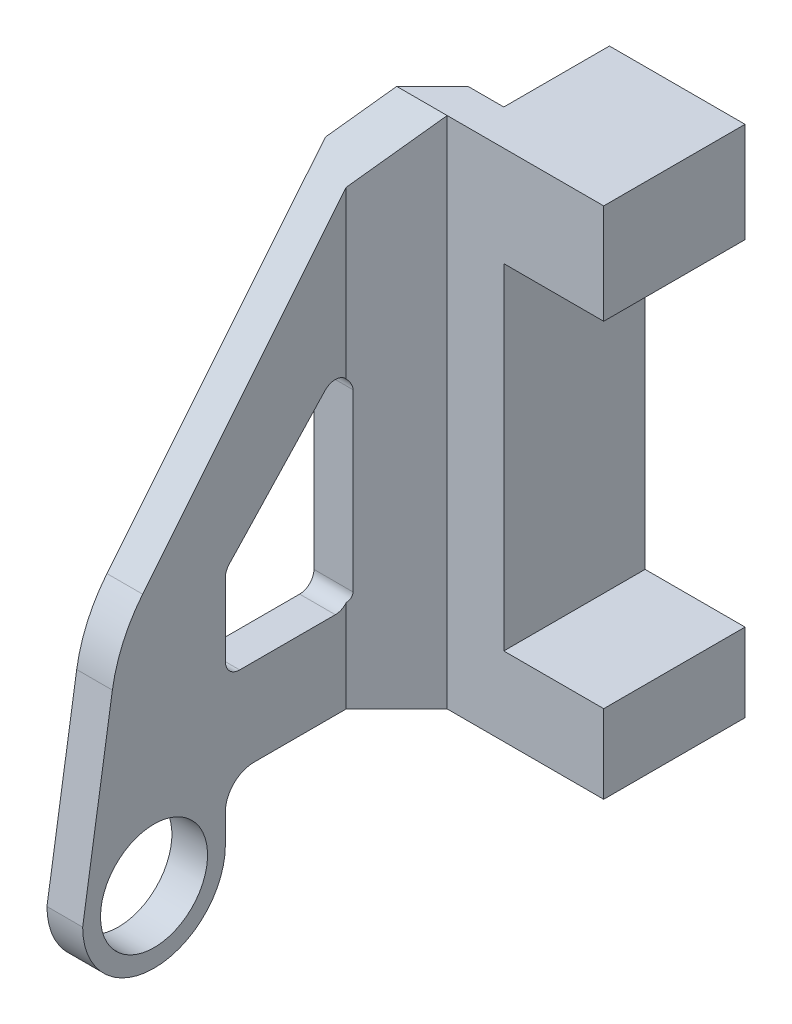
ISO-10303-21;
HEADER;
FILE_DESCRIPTION(('STEP AP214'),'2;1');
FILE_NAME('part.step','',(''),(''),'','','');
FILE_SCHEMA(('AUTOMOTIVE_DESIGN { 1 0 10303 214 1 1 1 1 }'));
ENDSEC;
DATA;
#1=APPLICATION_CONTEXT('core data for automotive mechanical design processes');
#2=APPLICATION_PROTOCOL_DEFINITION('international standard','automotive_design',2000,#1);
#3=PRODUCT_CONTEXT('',#1,'mechanical');
#4=PRODUCT('Part','Part','',(#3));
#5=PRODUCT_RELATED_PRODUCT_CATEGORY('part','',(#4));
#6=PRODUCT_DEFINITION_FORMATION('','',#4);
#7=PRODUCT_DEFINITION_CONTEXT('part definition',#1,'design');
#8=PRODUCT_DEFINITION('design','',#6,#7);
#9=PRODUCT_DEFINITION_SHAPE('','',#8);
#10=(LENGTH_UNIT() NAMED_UNIT(*) SI_UNIT(.MILLI.,.METRE.));
#11=(NAMED_UNIT(*) PLANE_ANGLE_UNIT() SI_UNIT($,.RADIAN.));
#12=(NAMED_UNIT(*) SI_UNIT($,.STERADIAN.) SOLID_ANGLE_UNIT());
#13=UNCERTAINTY_MEASURE_WITH_UNIT(LENGTH_MEASURE(1.E-05),#10,'distance_accuracy_value','');
#14=(GEOMETRIC_REPRESENTATION_CONTEXT(3) GLOBAL_UNCERTAINTY_ASSIGNED_CONTEXT((#13)) GLOBAL_UNIT_ASSIGNED_CONTEXT((#10,
#11,#12)) REPRESENTATION_CONTEXT('',''));
#15=CARTESIAN_POINT('',(0.,0.,0.));
#16=DIRECTION('',(0.,0.,1.));
#17=DIRECTION('',(1.,0.,0.));
#18=AXIS2_PLACEMENT_3D('',#15,#16,#17);
#19=CARTESIAN_POINT('',(-17.,-4.,26.9));
#20=DIRECTION('',(-1.,0.,0.));
#21=DIRECTION('',(0.,0.,1.));
#22=AXIS2_PLACEMENT_3D('',#19,#20,#21);
#23=PLANE('',#22);
#24=CARTESIAN_POINT('',(-17.,-4.,26.9));
#25=DIRECTION('',(-1.,0.,0.));
#26=DIRECTION('',(0.,0.,1.));
#27=AXIS2_PLACEMENT_3D('',#24,#25,#26);
#28=CIRCLE('',#27,3.75);
#29=CARTESIAN_POINT('',(-17.,-4.,30.65));
#30=VERTEX_POINT('',#29);
#31=EDGE_CURVE('E776',#30,#30,#28,.T.);
#32=ORIENTED_EDGE('',*,*,#31,.F.);
#33=EDGE_LOOP('',(#32));
#34=FACE_BOUND('',#33,.T.);
#35=DIRECTION('',(0.,0.988012033751101,-0.15437688027361));
#36=VECTOR('',#35,1.);
#37=CARTESIAN_POINT('',(-17.,-4.,31.9));
#38=LINE('',#37,#36);
#39=CARTESIAN_POINT('',(-17.,-4.,31.9));
#40=VERTEX_POINT('',#39);
#41=CARTESIAN_POINT('',(-17.,9.33291795760597,29.8167315691241));
#42=VERTEX_POINT('',#41);
#43=EDGE_CURVE('E312',#40,#42,#38,.T.);
#44=ORIENTED_EDGE('',*,*,#43,.T.);
#45=CARTESIAN_POINT('',(-17.,7.78914915486987,19.9366112316131));
#46=DIRECTION('',(-1.,0.,0.));
#47=DIRECTION('',(0.,0.,1.));
#48=AXIS2_PLACEMENT_3D('',#45,#46,#47);
#49=CIRCLE('',#48,10.);
#50=CARTESIAN_POINT('',(-17.,14.0950754058145,27.6977512327757));
#51=VERTEX_POINT('',#50);
#52=EDGE_CURVE('E367',#42,#51,#49,.T.);
#53=ORIENTED_EDGE('',*,*,#52,.T.);
#54=DIRECTION('',(0.,0.776114000116266,-0.630592625094466));
#55=VECTOR('',#54,1.);
#56=CARTESIAN_POINT('',(-17.,12.,29.4));
#57=LINE('',#56,#55);
#58=CARTESIAN_POINT('',(-17.,32.923076923077,12.3999999999999));
#59=VERTEX_POINT('',#58);
#60=EDGE_CURVE('E315',#51,#59,#57,.T.);
#61=ORIENTED_EDGE('',*,*,#60,.T.);
#62=DIRECTION('',(0.,1.,0.));
#63=VECTOR('',#62,1.);
#64=CARTESIAN_POINT('',(-17.,-4.,12.3999999999999));
#65=LINE('',#64,#63);
#66=CARTESIAN_POINT('',(-17.,0.,12.3999999999999));
#67=VERTEX_POINT('',#66);
#68=EDGE_CURVE('E299',#67,#59,#65,.T.);
#69=ORIENTED_EDGE('',*,*,#68,.F.);
#70=DIRECTION('',(0.,0.,1.));
#71=VECTOR('',#70,1.);
#72=CARTESIAN_POINT('',(-17.,0.,7.4));
#73=LINE('',#72,#71);
#74=CARTESIAN_POINT('',(-17.,0.,19.9));
#75=VERTEX_POINT('',#74);
#76=EDGE_CURVE('E306',#67,#75,#73,.T.);
#77=ORIENTED_EDGE('',*,*,#76,.T.);
#78=CARTESIAN_POINT('',(-17.,-2.,19.9));
#79=DIRECTION('',(-1.,0.,0.));
#80=DIRECTION('',(0.,0.,1.));
#81=AXIS2_PLACEMENT_3D('',#78,#79,#80);
#82=CIRCLE('',#81,2.);
#83=CARTESIAN_POINT('',(-17.,-2.,21.9));
#84=VERTEX_POINT('',#83);
#85=EDGE_CURVE('E11',#75,#84,#82,.F.);
#86=ORIENTED_EDGE('',*,*,#85,.T.);
#87=DIRECTION('',(0.,-1.,0.));
#88=VECTOR('',#87,1.);
#89=CARTESIAN_POINT('',(-17.,0.,21.9));
#90=LINE('',#89,#88);
#91=CARTESIAN_POINT('',(-17.,-4.,21.9));
#92=VERTEX_POINT('',#91);
#93=EDGE_CURVE('E308',#84,#92,#90,.T.);
#94=ORIENTED_EDGE('',*,*,#93,.T.);
#95=CARTESIAN_POINT('',(-17.,-4.,26.9));
#96=DIRECTION('',(-1.,0.,0.));
#97=DIRECTION('',(0.,0.,1.));
#98=AXIS2_PLACEMENT_3D('',#95,#96,#97);
#99=CIRCLE('',#98,5.);
#100=EDGE_CURVE('E310',#92,#40,#99,.T.);
#101=ORIENTED_EDGE('',*,*,#100,.T.);
#102=EDGE_LOOP('',(#44,#53,#61,#69,#77,#86,#94,#101));
#103=FACE_BOUND('',#102,.T.);
#104=CARTESIAN_POINT('',(-17.,19.3672423947041,14.2));
#105=DIRECTION('',(-1.,0.,0.));
#106=DIRECTION('',(0.,0.,1.));
#107=AXIS2_PLACEMENT_3D('',#104,#105,#106);
#108=CIRCLE('',#107,1.);
#109=CARTESIAN_POINT('',(-17.,20.0503995234798,14.9302714135189));
#110=VERTEX_POINT('',#109);
#111=CARTESIAN_POINT('',(-17.,19.3672423947041,13.2));
#112=VERTEX_POINT('',#111);
#113=EDGE_CURVE('E230',#110,#112,#108,.T.);
#114=ORIENTED_EDGE('',*,*,#113,.F.);
#115=DIRECTION('',(0.,-0.730271413518896,0.683157128775741));
#116=VECTOR('',#115,1.);
#117=CARTESIAN_POINT('',(-17.,16.8061598224195,17.965205327414));
#118=LINE('',#117,#116);
#119=CARTESIAN_POINT('',(-17.,12.8883305579626,21.6302714135189));
#120=VERTEX_POINT('',#119);
#121=EDGE_CURVE('E235',#110,#120,#118,.T.);
#122=ORIENTED_EDGE('',*,*,#121,.T.);
#123=CARTESIAN_POINT('',(-17.,12.2051734291868,20.9));
#124=DIRECTION('',(-1.,0.,0.));
#125=DIRECTION('',(0.,0.,1.));
#126=AXIS2_PLACEMENT_3D('',#123,#124,#125);
#127=CIRCLE('',#126,1.);
#128=CARTESIAN_POINT('',(-17.,12.2051734291868,21.9));
#129=VERTEX_POINT('',#128);
#130=EDGE_CURVE('E252',#129,#120,#127,.T.);
#131=ORIENTED_EDGE('',*,*,#130,.F.);
#132=DIRECTION('',(0.,-1.,0.));
#133=VECTOR('',#132,1.);
#134=CARTESIAN_POINT('',(-17.,0.,21.9));
#135=LINE('',#134,#133);
#136=CARTESIAN_POINT('',(-17.,7.1,21.9));
#137=VERTEX_POINT('',#136);
#138=EDGE_CURVE('E249',#129,#137,#135,.T.);
#139=ORIENTED_EDGE('',*,*,#138,.T.);
#140=CARTESIAN_POINT('',(-17.,7.1,20.9));
#141=DIRECTION('',(-1.,0.,0.));
#142=DIRECTION('',(0.,0.,1.));
#143=AXIS2_PLACEMENT_3D('',#140,#141,#142);
#144=CIRCLE('',#143,1.);
#145=CARTESIAN_POINT('',(-17.,6.1,20.9));
#146=VERTEX_POINT('',#145);
#147=EDGE_CURVE('E246',#146,#137,#144,.T.);
#148=ORIENTED_EDGE('',*,*,#147,.F.);
#149=DIRECTION('',(0.,0.,-1.));
#150=VECTOR('',#149,1.);
#151=CARTESIAN_POINT('',(-17.,6.1,0.));
#152=LINE('',#151,#150);
#153=CARTESIAN_POINT('',(-17.,6.09999999999999,14.2));
#154=VERTEX_POINT('',#153);
#155=EDGE_CURVE('E241',#146,#154,#152,.T.);
#156=ORIENTED_EDGE('',*,*,#155,.T.);
#157=CARTESIAN_POINT('',(-17.,7.1,14.2));
#158=DIRECTION('',(-1.,0.,0.));
#159=DIRECTION('',(0.,0.,1.));
#160=AXIS2_PLACEMENT_3D('',#157,#158,#159);
#161=CIRCLE('',#160,1.);
#162=CARTESIAN_POINT('',(-17.,7.1,13.2));
#163=VERTEX_POINT('',#162);
#164=EDGE_CURVE('E239',#163,#154,#161,.T.);
#165=ORIENTED_EDGE('',*,*,#164,.F.);
#166=DIRECTION('',(0.,1.,0.));
#167=VECTOR('',#166,1.);
#168=CARTESIAN_POINT('',(-17.,0.,13.2));
#169=LINE('',#168,#167);
#170=EDGE_CURVE('E219',#163,#112,#169,.T.);
#171=ORIENTED_EDGE('',*,*,#170,.T.);
#172=EDGE_LOOP('',(#114,#122,#131,#139,#148,#156,#165,#171));
#173=FACE_BOUND('',#172,.T.);
#174=ADVANCED_FACE('F32',(#34,#103,#173),#23,.T.);
#175=CARTESIAN_POINT('',(-9.5,36.,9.9));
#176=DIRECTION('',(1.,0.,0.));
#177=DIRECTION('',(0.,0.,-1.));
#178=AXIS2_PLACEMENT_3D('',#175,#176,#177);
#179=PLANE('',#178);
#180=DIRECTION('',(0.,-1.,0.));
#181=VECTOR('',#180,1.);
#182=CARTESIAN_POINT('',(-9.5,0.,7.4));
#183=LINE('',#182,#181);
#184=CARTESIAN_POINT('',(-9.5,36.,7.4));
#185=VERTEX_POINT('',#184);
#186=CARTESIAN_POINT('',(-9.5,0.,7.4));
#187=VERTEX_POINT('',#186);
#188=EDGE_CURVE('E305',#185,#187,#183,.T.);
#189=ORIENTED_EDGE('',*,*,#188,.F.);
#190=DIRECTION('',(0.,0.,-1.));
#191=VECTOR('',#190,1.);
#192=CARTESIAN_POINT('',(-9.5,36.,9.9));
#193=LINE('',#192,#191);
#194=CARTESIAN_POINT('',(-9.5,36.,0.));
#195=VERTEX_POINT('',#194);
#196=EDGE_CURVE('E445',#185,#195,#193,.T.);
#197=ORIENTED_EDGE('',*,*,#196,.T.);
#198=DIRECTION('',(0.,-1.,0.));
#199=VECTOR('',#198,1.);
#200=CARTESIAN_POINT('',(-9.5,36.,0.));
#201=LINE('',#200,#199);
#202=CARTESIAN_POINT('',(-9.5,0.,0.));
#203=VERTEX_POINT('',#202);
#204=EDGE_CURVE('E436',#195,#203,#201,.T.);
#205=ORIENTED_EDGE('',*,*,#204,.T.);
#206=DIRECTION('',(0.,0.,-1.));
#207=VECTOR('',#206,1.);
#208=CARTESIAN_POINT('',(-9.5,0.,9.9));
#209=LINE('',#208,#207);
#210=EDGE_CURVE('E426',#187,#203,#209,.T.);
#211=ORIENTED_EDGE('',*,*,#210,.F.);
#212=EDGE_LOOP('',(#189,#197,#205,#211));
#213=FACE_BOUND('',#212,.T.);
#214=ADVANCED_FACE('F478',(#213),#179,.F.);
#215=CARTESIAN_POINT('',(0.,0.,9.9));
#216=DIRECTION('',(-1.,0.,0.));
#217=DIRECTION('',(0.,-1.,0.));
#218=AXIS2_PLACEMENT_3D('',#215,#216,#217);
#219=PLANE('',#218);
#220=DIRECTION('',(0.,1.,0.));
#221=VECTOR('',#220,1.);
#222=CARTESIAN_POINT('',(0.,0.,0.));
#223=LINE('',#222,#221);
#224=CARTESIAN_POINT('',(0.,0.,0.));
#225=VERTEX_POINT('',#224);
#226=CARTESIAN_POINT('',(0.,5.5,0.));
#227=VERTEX_POINT('',#226);
#228=EDGE_CURVE('E430',#225,#227,#223,.T.);
#229=ORIENTED_EDGE('',*,*,#228,.T.);
#230=DIRECTION('',(0.,0.,1.));
#231=VECTOR('',#230,1.);
#232=CARTESIAN_POINT('',(0.,5.5,0.));
#233=LINE('',#232,#231);
#234=CARTESIAN_POINT('',(0.,5.5,9.9));
#235=VERTEX_POINT('',#234);
#236=EDGE_CURVE('E410',#227,#235,#233,.T.);
#237=ORIENTED_EDGE('',*,*,#236,.T.);
#238=DIRECTION('',(0.,1.,0.));
#239=VECTOR('',#238,1.);
#240=CARTESIAN_POINT('',(0.,0.,9.9));
#241=LINE('',#240,#239);
#242=CARTESIAN_POINT('',(0.,0.,9.9));
#243=VERTEX_POINT('',#242);
#244=EDGE_CURVE('E420',#243,#235,#241,.T.);
#245=ORIENTED_EDGE('',*,*,#244,.F.);
#246=DIRECTION('',(0.,0.,-1.));
#247=VECTOR('',#246,1.);
#248=CARTESIAN_POINT('',(0.,0.,9.9));
#249=LINE('',#248,#247);
#250=EDGE_CURVE('E446',#243,#225,#249,.T.);
#251=ORIENTED_EDGE('',*,*,#250,.T.);
#252=EDGE_LOOP('',(#229,#237,#245,#251));
#253=FACE_BOUND('',#252,.T.);
#254=ADVANCED_FACE('F509',(#253),#219,.F.);
#255=CARTESIAN_POINT('',(-9.5,0.,9.9));
#256=DIRECTION('',(0.,1.,0.));
#257=DIRECTION('',(0.,0.,1.));
#258=AXIS2_PLACEMENT_3D('',#255,#256,#257);
#259=PLANE('',#258);
#260=DIRECTION('',(0.,0.,1.));
#261=VECTOR('',#260,1.);
#262=CARTESIAN_POINT('',(-14.5,0.,9.9));
#263=LINE('',#262,#261);
#264=CARTESIAN_POINT('',(-14.5,0.,13.4355339059327));
#265=VERTEX_POINT('',#264);
#266=CARTESIAN_POINT('',(-14.5,0.,19.9));
#267=VERTEX_POINT('',#266);
#268=EDGE_CURVE('E289',#265,#267,#263,.T.);
#269=ORIENTED_EDGE('',*,*,#268,.T.);
#270=DIRECTION('',(1.,0.,0.));
#271=VECTOR('',#270,1.);
#272=CARTESIAN_POINT('',(-17.,0.,19.9));
#273=LINE('',#272,#271);
#274=EDGE_CURVE('E48',#267,#75,#273,.F.);
#275=ORIENTED_EDGE('',*,*,#274,.T.);
#276=ORIENTED_EDGE('',*,*,#76,.F.);
#277=DIRECTION('',(0.707106781186551,0.,-0.707106781186544));
#278=VECTOR('',#277,1.);
#279=CARTESIAN_POINT('',(-12.,0.,7.39999999999999));
#280=LINE('',#279,#278);
#281=CARTESIAN_POINT('',(-12.,0.,7.4));
#282=VERTEX_POINT('',#281);
#283=EDGE_CURVE('E302',#67,#282,#280,.T.);
#284=ORIENTED_EDGE('',*,*,#283,.T.);
#285=DIRECTION('',(1.,0.,0.));
#286=VECTOR('',#285,1.);
#287=CARTESIAN_POINT('',(-17.,0.,7.4));
#288=LINE('',#287,#286);
#289=EDGE_CURVE('E335',#282,#187,#288,.T.);
#290=ORIENTED_EDGE('',*,*,#289,.T.);
#291=ORIENTED_EDGE('',*,*,#210,.T.);
#292=DIRECTION('',(1.,0.,0.));
#293=VECTOR('',#292,1.);
#294=CARTESIAN_POINT('',(-9.5,0.,0.));
#295=LINE('',#294,#293);
#296=EDGE_CURVE('E413',#203,#225,#295,.T.);
#297=ORIENTED_EDGE('',*,*,#296,.T.);
#298=ORIENTED_EDGE('',*,*,#250,.F.);
#299=DIRECTION('',(1.,0.,0.));
#300=VECTOR('',#299,1.);
#301=CARTESIAN_POINT('',(-9.5,0.,9.9));
#302=LINE('',#301,#300);
#303=CARTESIAN_POINT('',(-10.9644660940673,0.,9.9));
#304=VERTEX_POINT('',#303);
#305=EDGE_CURVE('E330',#304,#243,#302,.T.);
#306=ORIENTED_EDGE('',*,*,#305,.F.);
#307=DIRECTION('',(-0.707106781186551,0.,0.707106781186544));
#308=VECTOR('',#307,1.);
#309=CARTESIAN_POINT('',(-10.2322330470336,0.,9.16776695296636));
#310=LINE('',#309,#308);
#311=EDGE_CURVE('E291',#304,#265,#310,.T.);
#312=ORIENTED_EDGE('',*,*,#311,.T.);
#313=EDGE_LOOP('',(#269,#275,#276,#284,#290,#291,#297,#298,#306,#312));
#314=FACE_BOUND('',#313,.T.);
#315=ADVANCED_FACE('F481',(#314),#259,.F.);
#316=CARTESIAN_POINT('',(0.,29.,9.9));
#317=VERTEX_POINT('',#316);
#318=CARTESIAN_POINT('',(0.,36.,9.9));
#319=VERTEX_POINT('',#318);
#320=EDGE_CURVE('E424',#317,#319,#241,.T.);
#321=ORIENTED_EDGE('',*,*,#320,.F.);
#322=DIRECTION('',(0.,0.,1.));
#323=VECTOR('',#322,1.);
#324=CARTESIAN_POINT('',(0.,29.,0.));
#325=LINE('',#324,#323);
#326=CARTESIAN_POINT('',(0.,29.,0.));
#327=VERTEX_POINT('',#326);
#328=EDGE_CURVE('E404',#327,#317,#325,.T.);
#329=ORIENTED_EDGE('',*,*,#328,.F.);
#330=CARTESIAN_POINT('',(0.,36.,0.));
#331=VERTEX_POINT('',#330);
#332=EDGE_CURVE('E429',#327,#331,#223,.T.);
#333=ORIENTED_EDGE('',*,*,#332,.T.);
#334=DIRECTION('',(0.,0.,-1.));
#335=VECTOR('',#334,1.);
#336=CARTESIAN_POINT('',(0.,36.,9.9));
#337=LINE('',#336,#335);
#338=EDGE_CURVE('E447',#319,#331,#337,.T.);
#339=ORIENTED_EDGE('',*,*,#338,.F.);
#340=EDGE_LOOP('',(#321,#329,#333,#339));
#341=FACE_BOUND('',#340,.T.);
#342=ADVANCED_FACE('F504',(#341),#219,.F.);
#343=CARTESIAN_POINT('',(0.,36.,9.9));
#344=DIRECTION('',(0.,-1.,0.));
#345=DIRECTION('',(0.,0.,-1.));
#346=AXIS2_PLACEMENT_3D('',#343,#344,#345);
#347=PLANE('',#346);
#348=DIRECTION('',(1.,0.,0.));
#349=VECTOR('',#348,1.);
#350=CARTESIAN_POINT('',(-17.,36.,7.4));
#351=LINE('',#350,#349);
#352=CARTESIAN_POINT('',(-12.,36.,7.4));
#353=VERTEX_POINT('',#352);
#354=EDGE_CURVE('E317',#353,#185,#351,.T.);
#355=ORIENTED_EDGE('',*,*,#354,.F.);
#356=DIRECTION('',(0.707106781186551,0.,-0.707106781186544));
#357=VECTOR('',#356,1.);
#358=CARTESIAN_POINT('',(-12.,36.,7.4));
#359=LINE('',#358,#357);
#360=CARTESIAN_POINT('',(-14.5,36.,9.9));
#361=VERTEX_POINT('',#360);
#362=EDGE_CURVE('E294',#361,#353,#359,.T.);
#363=ORIENTED_EDGE('',*,*,#362,.F.);
#364=DIRECTION('',(1.,0.,0.));
#365=VECTOR('',#364,1.);
#366=CARTESIAN_POINT('',(-17.,36.,9.9));
#367=LINE('',#366,#365);
#368=CARTESIAN_POINT('',(-10.9644660940673,36.,9.9));
#369=VERTEX_POINT('',#368);
#370=EDGE_CURVE('E320',#361,#369,#367,.T.);
#371=ORIENTED_EDGE('',*,*,#370,.T.);
#372=DIRECTION('',(-1.,0.,0.));
#373=VECTOR('',#372,1.);
#374=CARTESIAN_POINT('',(0.,36.,9.9));
#375=LINE('',#374,#373);
#376=EDGE_CURVE('E423',#319,#369,#375,.T.);
#377=ORIENTED_EDGE('',*,*,#376,.F.);
#378=ORIENTED_EDGE('',*,*,#338,.T.);
#379=DIRECTION('',(-1.,0.,0.));
#380=VECTOR('',#379,1.);
#381=CARTESIAN_POINT('',(0.,36.,0.));
#382=LINE('',#381,#380);
#383=EDGE_CURVE('E433',#331,#195,#382,.T.);
#384=ORIENTED_EDGE('',*,*,#383,.T.);
#385=ORIENTED_EDGE('',*,*,#196,.F.);
#386=EDGE_LOOP('',(#355,#363,#371,#377,#378,#384,#385));
#387=FACE_BOUND('',#386,.T.);
#388=ADVANCED_FACE('F473',(#387),#347,.F.);
#389=CARTESIAN_POINT('',(0.,0.,9.9));
#390=DIRECTION('',(0.,0.,1.));
#391=DIRECTION('',(1.,0.,0.));
#392=AXIS2_PLACEMENT_3D('',#389,#390,#391);
#393=PLANE('',#392);
#394=ORIENTED_EDGE('',*,*,#376,.T.);
#395=DIRECTION('',(0.,1.,0.));
#396=VECTOR('',#395,1.);
#397=CARTESIAN_POINT('',(-10.9644660940673,-101.5,9.9));
#398=LINE('',#397,#396);
#399=EDGE_CURVE('E272',#304,#369,#398,.T.);
#400=ORIENTED_EDGE('',*,*,#399,.F.);
#401=ORIENTED_EDGE('',*,*,#305,.T.);
#402=ORIENTED_EDGE('',*,*,#244,.T.);
#403=DIRECTION('',(1.,0.,0.));
#404=VECTOR('',#403,1.);
#405=CARTESIAN_POINT('',(-7.,5.5,9.9));
#406=LINE('',#405,#404);
#407=CARTESIAN_POINT('',(-7.,5.5,9.9));
#408=VERTEX_POINT('',#407);
#409=EDGE_CURVE('E398',#408,#235,#406,.T.);
#410=ORIENTED_EDGE('',*,*,#409,.F.);
#411=DIRECTION('',(0.,-1.,0.));
#412=VECTOR('',#411,1.);
#413=CARTESIAN_POINT('',(-7.,29.,9.9));
#414=LINE('',#413,#412);
#415=CARTESIAN_POINT('',(-7.,29.,9.9));
#416=VERTEX_POINT('',#415);
#417=EDGE_CURVE('E406',#416,#408,#414,.T.);
#418=ORIENTED_EDGE('',*,*,#417,.F.);
#419=DIRECTION('',(-1.,0.,0.));
#420=VECTOR('',#419,1.);
#421=CARTESIAN_POINT('',(0.,29.,9.9));
#422=LINE('',#421,#420);
#423=EDGE_CURVE('E392',#317,#416,#422,.T.);
#424=ORIENTED_EDGE('',*,*,#423,.F.);
#425=ORIENTED_EDGE('',*,*,#320,.T.);
#426=EDGE_LOOP('',(#394,#400,#401,#402,#410,#418,#424,#425));
#427=FACE_BOUND('',#426,.T.);
#428=ADVANCED_FACE('F498',(#427),#393,.T.);
#429=CARTESIAN_POINT('',(0.,0.,0.));
#430=DIRECTION('',(0.,0.,1.));
#431=DIRECTION('',(1.,0.,0.));
#432=AXIS2_PLACEMENT_3D('',#429,#430,#431);
#433=PLANE('',#432);
#434=DIRECTION('',(0.,-1.,0.));
#435=VECTOR('',#434,1.);
#436=CARTESIAN_POINT('',(-7.,29.,0.));
#437=LINE('',#436,#435);
#438=CARTESIAN_POINT('',(-7.,29.,0.));
#439=VERTEX_POINT('',#438);
#440=CARTESIAN_POINT('',(-7.,5.5,0.));
#441=VERTEX_POINT('',#440);
#442=EDGE_CURVE('E397',#439,#441,#437,.T.);
#443=ORIENTED_EDGE('',*,*,#442,.T.);
#444=DIRECTION('',(1.,0.,0.));
#445=VECTOR('',#444,1.);
#446=CARTESIAN_POINT('',(-7.,5.5,0.));
#447=LINE('',#446,#445);
#448=EDGE_CURVE('E401',#441,#227,#447,.T.);
#449=ORIENTED_EDGE('',*,*,#448,.T.);
#450=ORIENTED_EDGE('',*,*,#228,.F.);
#451=ORIENTED_EDGE('',*,*,#296,.F.);
#452=ORIENTED_EDGE('',*,*,#204,.F.);
#453=ORIENTED_EDGE('',*,*,#383,.F.);
#454=ORIENTED_EDGE('',*,*,#332,.F.);
#455=DIRECTION('',(-1.,0.,0.));
#456=VECTOR('',#455,1.);
#457=CARTESIAN_POINT('',(0.,29.,0.));
#458=LINE('',#457,#456);
#459=EDGE_CURVE('E394',#327,#439,#458,.T.);
#460=ORIENTED_EDGE('',*,*,#459,.T.);
#461=EDGE_LOOP('',(#443,#449,#450,#451,#452,#453,#454,#460));
#462=FACE_BOUND('',#461,.T.);
#463=ADVANCED_FACE('F507',(#462),#433,.F.);
#464=CARTESIAN_POINT('',(-7.,5.5,0.));
#465=DIRECTION('',(0.,-1.,0.));
#466=DIRECTION('',(0.,0.,-1.));
#467=AXIS2_PLACEMENT_3D('',#464,#465,#466);
#468=PLANE('',#467);
#469=ORIENTED_EDGE('',*,*,#409,.T.);
#470=ORIENTED_EDGE('',*,*,#236,.F.);
#471=ORIENTED_EDGE('',*,*,#448,.F.);
#472=DIRECTION('',(0.,0.,1.));
#473=VECTOR('',#472,1.);
#474=CARTESIAN_POINT('',(-7.,5.5,0.));
#475=LINE('',#474,#473);
#476=EDGE_CURVE('E414',#441,#408,#475,.T.);
#477=ORIENTED_EDGE('',*,*,#476,.T.);
#478=EDGE_LOOP('',(#469,#470,#471,#477));
#479=FACE_BOUND('',#478,.T.);
#480=ADVANCED_FACE('F512',(#479),#468,.F.);
#481=CARTESIAN_POINT('',(-7.,29.,0.));
#482=DIRECTION('',(-1.,0.,0.));
#483=DIRECTION('',(0.,-1.,0.));
#484=AXIS2_PLACEMENT_3D('',#481,#482,#483);
#485=PLANE('',#484);
#486=ORIENTED_EDGE('',*,*,#417,.T.);
#487=ORIENTED_EDGE('',*,*,#476,.F.);
#488=ORIENTED_EDGE('',*,*,#442,.F.);
#489=DIRECTION('',(0.,0.,1.));
#490=VECTOR('',#489,1.);
#491=CARTESIAN_POINT('',(-7.,29.,0.));
#492=LINE('',#491,#490);
#493=EDGE_CURVE('E416',#439,#416,#492,.T.);
#494=ORIENTED_EDGE('',*,*,#493,.T.);
#495=EDGE_LOOP('',(#486,#487,#488,#494));
#496=FACE_BOUND('',#495,.T.);
#497=ADVANCED_FACE('F514',(#496),#485,.F.);
#498=CARTESIAN_POINT('',(0.,29.,0.));
#499=DIRECTION('',(0.,1.,0.));
#500=DIRECTION('',(0.,0.,1.));
#501=AXIS2_PLACEMENT_3D('',#498,#499,#500);
#502=PLANE('',#501);
#503=ORIENTED_EDGE('',*,*,#423,.T.);
#504=ORIENTED_EDGE('',*,*,#493,.F.);
#505=ORIENTED_EDGE('',*,*,#459,.F.);
#506=ORIENTED_EDGE('',*,*,#328,.T.);
#507=EDGE_LOOP('',(#503,#504,#505,#506));
#508=FACE_BOUND('',#507,.T.);
#509=ADVANCED_FACE('F517',(#508),#502,.F.);
#510=CARTESIAN_POINT('',(-17.,0.,7.4));
#511=DIRECTION('',(0.,0.,1.));
#512=DIRECTION('',(1.,0.,0.));
#513=AXIS2_PLACEMENT_3D('',#510,#511,#512);
#514=PLANE('',#513);
#515=ORIENTED_EDGE('',*,*,#289,.F.);
#516=DIRECTION('',(0.,1.,0.));
#517=VECTOR('',#516,1.);
#518=CARTESIAN_POINT('',(-12.,-101.5,7.4));
#519=LINE('',#518,#517);
#520=EDGE_CURVE('E296',#282,#353,#519,.T.);
#521=ORIENTED_EDGE('',*,*,#520,.T.);
#522=ORIENTED_EDGE('',*,*,#354,.T.);
#523=ORIENTED_EDGE('',*,*,#188,.T.);
#524=EDGE_LOOP('',(#515,#521,#522,#523));
#525=FACE_BOUND('',#524,.T.);
#526=ADVANCED_FACE('F476',(#525),#514,.F.);
#527=CARTESIAN_POINT('',(-17.,0.,21.9));
#528=DIRECTION('',(0.,0.,1.));
#529=DIRECTION('',(1.,0.,0.));
#530=AXIS2_PLACEMENT_3D('',#527,#528,#529);
#531=PLANE('',#530);
#532=ORIENTED_EDGE('',*,*,#93,.F.);
#533=DIRECTION('',(1.,0.,0.));
#534=VECTOR('',#533,1.);
#535=CARTESIAN_POINT('',(-14.5,-2.,21.9));
#536=LINE('',#535,#534);
#537=CARTESIAN_POINT('',(-14.5,-2.,21.9));
#538=VERTEX_POINT('',#537);
#539=EDGE_CURVE('E369',#84,#538,#536,.T.);
#540=ORIENTED_EDGE('',*,*,#539,.T.);
#541=DIRECTION('',(0.,-1.,0.));
#542=VECTOR('',#541,1.);
#543=CARTESIAN_POINT('',(-14.5,0.,21.9));
#544=LINE('',#543,#542);
#545=CARTESIAN_POINT('',(-14.5,-4.,21.9));
#546=VERTEX_POINT('',#545);
#547=EDGE_CURVE('E287',#538,#546,#544,.T.);
#548=ORIENTED_EDGE('',*,*,#547,.T.);
#549=DIRECTION('',(1.,0.,0.));
#550=VECTOR('',#549,1.);
#551=CARTESIAN_POINT('',(-17.,-4.,21.9));
#552=LINE('',#551,#550);
#553=EDGE_CURVE('E388',#92,#546,#552,.T.);
#554=ORIENTED_EDGE('',*,*,#553,.F.);
#555=EDGE_LOOP('',(#532,#540,#548,#554));
#556=FACE_BOUND('',#555,.T.);
#557=ADVANCED_FACE('F376',(#556),#531,.F.);
#558=CARTESIAN_POINT('',(-17.,-4.,26.9));
#559=DIRECTION('',(1.,0.,0.));
#560=DIRECTION('',(0.,0.,-1.));
#561=AXIS2_PLACEMENT_3D('',#558,#559,#560);
#562=CYLINDRICAL_SURFACE('',#561,5.);
#563=ORIENTED_EDGE('',*,*,#553,.T.);
#564=CARTESIAN_POINT('',(-14.5,-4.,26.9));
#565=DIRECTION('',(-1.,0.,0.));
#566=DIRECTION('',(0.,0.,1.));
#567=AXIS2_PLACEMENT_3D('',#564,#565,#566);
#568=CIRCLE('',#567,5.);
#569=CARTESIAN_POINT('',(-14.5,-4.,31.9));
#570=VERTEX_POINT('',#569);
#571=EDGE_CURVE('E284',#546,#570,#568,.T.);
#572=ORIENTED_EDGE('',*,*,#571,.T.);
#573=DIRECTION('',(1.,0.,0.));
#574=VECTOR('',#573,1.);
#575=CARTESIAN_POINT('',(-17.,-4.,31.9));
#576=LINE('',#575,#574);
#577=EDGE_CURVE('E390',#40,#570,#576,.T.);
#578=ORIENTED_EDGE('',*,*,#577,.F.);
#579=ORIENTED_EDGE('',*,*,#100,.F.);
#580=EDGE_LOOP('',(#563,#572,#578,#579));
#581=FACE_BOUND('',#580,.T.);
#582=ADVANCED_FACE('F389',(#581),#562,.T.);
#583=CARTESIAN_POINT('',(-17.,-4.,31.9));
#584=DIRECTION('',(0.,-0.15437688027361,-0.988012033751101));
#585=DIRECTION('',(0.,0.988012033751101,-0.15437688027361));
#586=AXIS2_PLACEMENT_3D('',#583,#584,#585);
#587=PLANE('',#586);
#588=DIRECTION('',(0.,0.988012033751101,-0.15437688027361));
#589=VECTOR('',#588,1.);
#590=CARTESIAN_POINT('',(-14.5,-4.,31.9));
#591=LINE('',#590,#589);
#592=CARTESIAN_POINT('',(-14.5,9.33291795760597,29.8167315691241));
#593=VERTEX_POINT('',#592);
#594=EDGE_CURVE('E281',#570,#593,#591,.T.);
#595=ORIENTED_EDGE('',*,*,#594,.T.);
#596=DIRECTION('',(1.,0.,0.));
#597=VECTOR('',#596,1.);
#598=CARTESIAN_POINT('',(-17.,9.33291795760597,29.8167315691241));
#599=LINE('',#598,#597);
#600=EDGE_CURVE('E365',#593,#42,#599,.F.);
#601=ORIENTED_EDGE('',*,*,#600,.T.);
#602=ORIENTED_EDGE('',*,*,#43,.F.);
#603=ORIENTED_EDGE('',*,*,#577,.T.);
#604=EDGE_LOOP('',(#595,#601,#602,#603));
#605=FACE_BOUND('',#604,.T.);
#606=ADVANCED_FACE('F540',(#605),#587,.F.);
#607=CARTESIAN_POINT('',(-17.,36.,9.9));
#608=DIRECTION('',(0.,-0.630592625094466,-0.776114000116265));
#609=DIRECTION('',(0.,0.776114000116266,-0.630592625094466));
#610=AXIS2_PLACEMENT_3D('',#607,#608,#609);
#611=PLANE('',#610);
#612=ORIENTED_EDGE('',*,*,#60,.F.);
#613=DIRECTION('',(1.,0.,0.));
#614=VECTOR('',#613,1.);
#615=CARTESIAN_POINT('',(-17.,14.0950754058145,27.6977512327757));
#616=LINE('',#615,#614);
#617=CARTESIAN_POINT('',(-14.5,14.0950754058145,27.6977512327757));
#618=VERTEX_POINT('',#617);
#619=EDGE_CURVE('E360',#51,#618,#616,.T.);
#620=ORIENTED_EDGE('',*,*,#619,.T.);
#621=DIRECTION('',(0.,0.776114000116266,-0.630592625094466));
#622=VECTOR('',#621,1.);
#623=CARTESIAN_POINT('',(-14.5,36.,9.9));
#624=LINE('',#623,#622);
#625=CARTESIAN_POINT('',(-14.5,31.6485736542367,13.4355339059327));
#626=VERTEX_POINT('',#625);
#627=EDGE_CURVE('E276',#618,#626,#624,.T.);
#628=ORIENTED_EDGE('',*,*,#627,.T.);
#629=DIRECTION('',(0.533396460910446,0.656487951889773,-0.53339646091044));
#630=VECTOR('',#629,1.);
#631=CARTESIAN_POINT('',(-12.6816466161256,33.8865470497744,11.6171805220583));
#632=LINE('',#631,#630);
#633=EDGE_CURVE('E337',#626,#369,#632,.T.);
#634=ORIENTED_EDGE('',*,*,#633,.T.);
#635=ORIENTED_EDGE('',*,*,#370,.F.);
#636=DIRECTION('',(-0.533396460910446,-0.656487951889772,0.53339646091044));
#637=VECTOR('',#636,1.);
#638=CARTESIAN_POINT('',(-15.2112794612795,35.1245791245791,10.6112794612795));
#639=LINE('',#638,#637);
#640=EDGE_CURVE('E341',#361,#59,#639,.T.);
#641=ORIENTED_EDGE('',*,*,#640,.T.);
#642=EDGE_LOOP('',(#612,#620,#628,#634,#635,#641));
#643=FACE_BOUND('',#642,.T.);
#644=ADVANCED_FACE('F465',(#643),#611,.F.);
#645=CARTESIAN_POINT('',(-12.,-101.5,7.4));
#646=DIRECTION('',(0.707106781186544,0.,0.707106781186551));
#647=DIRECTION('',(0.707106781186551,0.,-0.707106781186544));
#648=AXIS2_PLACEMENT_3D('',#645,#646,#647);
#649=PLANE('',#648);
#650=ORIENTED_EDGE('',*,*,#68,.T.);
#651=ORIENTED_EDGE('',*,*,#640,.F.);
#652=ORIENTED_EDGE('',*,*,#362,.T.);
#653=ORIENTED_EDGE('',*,*,#520,.F.);
#654=ORIENTED_EDGE('',*,*,#283,.F.);
#655=EDGE_LOOP('',(#650,#651,#652,#653,#654));
#656=FACE_BOUND('',#655,.T.);
#657=ADVANCED_FACE('F470',(#656),#649,.F.);
#658=CARTESIAN_POINT('',(-10.9644660940673,-101.5,9.9));
#659=DIRECTION('',(-0.707106781186544,0.,-0.707106781186551));
#660=DIRECTION('',(-0.707106781186551,0.,0.707106781186544));
#661=AXIS2_PLACEMENT_3D('',#658,#659,#660);
#662=PLANE('',#661);
#663=DIRECTION('',(0.,1.,0.));
#664=VECTOR('',#663,1.);
#665=CARTESIAN_POINT('',(-14.2644660940673,-101.5,13.2));
#666=LINE('',#665,#664);
#667=CARTESIAN_POINT('',(-14.2644660940673,7.1,13.2));
#668=VERTEX_POINT('',#667);
#669=CARTESIAN_POINT('',(-14.2644660940673,19.3672423947041,13.2));
#670=VERTEX_POINT('',#669);
#671=EDGE_CURVE('E222',#668,#670,#666,.T.);
#672=ORIENTED_EDGE('',*,*,#671,.F.);
#673=CARTESIAN_POINT('',(-15.2644660940673,7.1,14.2));
#674=DIRECTION('',(-0.707106781186544,0.,-0.707106781186551));
#675=DIRECTION('',(-0.707106781186551,0.,0.707106781186544));
#676=AXIS2_PLACEMENT_3D('',#673,#674,#675);
#677=ELLIPSE('',#676,1.4142135623731,1.);
#678=CARTESIAN_POINT('',(-14.5,6.4553360635017,13.4355339059327));
#679=VERTEX_POINT('',#678);
#680=EDGE_CURVE('E269',#668,#679,#677,.T.);
#681=ORIENTED_EDGE('',*,*,#680,.T.);
#682=DIRECTION('',(0.,1.,0.));
#683=VECTOR('',#682,1.);
#684=CARTESIAN_POINT('',(-14.5,-101.5,13.4355339059327));
#685=LINE('',#684,#683);
#686=EDGE_CURVE('E273',#265,#679,#685,.T.);
#687=ORIENTED_EDGE('',*,*,#686,.F.);
#688=ORIENTED_EDGE('',*,*,#311,.F.);
#689=ORIENTED_EDGE('',*,*,#399,.T.);
#690=ORIENTED_EDGE('',*,*,#633,.F.);
#691=CARTESIAN_POINT('',(-14.5,20.0119063312024,13.4355339059327));
#692=VERTEX_POINT('',#691);
#693=EDGE_CURVE('E277',#692,#626,#685,.T.);
#694=ORIENTED_EDGE('',*,*,#693,.F.);
#695=CARTESIAN_POINT('',(-15.2644660940673,19.3672423947041,14.2));
#696=DIRECTION('',(-0.707106781186544,0.,-0.707106781186551));
#697=DIRECTION('',(-0.707106781186551,0.,0.707106781186544));
#698=AXIS2_PLACEMENT_3D('',#695,#696,#697);
#699=ELLIPSE('',#698,1.4142135623731,1.);
#700=EDGE_CURVE('E257',#692,#670,#699,.T.);
#701=ORIENTED_EDGE('',*,*,#700,.T.);
#702=EDGE_LOOP('',(#672,#681,#687,#688,#689,#690,#694,#701));
#703=FACE_BOUND('',#702,.T.);
#704=ADVANCED_FACE('F493',(#703),#662,.F.);
#705=CARTESIAN_POINT('',(-14.5,-101.5,13.4355339059327));
#706=DIRECTION('',(-1.,0.,0.));
#707=DIRECTION('',(0.,0.,1.));
#708=AXIS2_PLACEMENT_3D('',#705,#706,#707);
#709=PLANE('',#708);
#710=CARTESIAN_POINT('',(-14.5,-4.,26.9));
#711=DIRECTION('',(-1.,0.,0.));
#712=DIRECTION('',(0.,0.,1.));
#713=AXIS2_PLACEMENT_3D('',#710,#711,#712);
#714=CIRCLE('',#713,3.75);
#715=CARTESIAN_POINT('',(-14.5,-4.,30.65));
#716=VERTEX_POINT('',#715);
#717=EDGE_CURVE('E36',#716,#716,#714,.T.);
#718=ORIENTED_EDGE('',*,*,#717,.T.);
#719=EDGE_LOOP('',(#718));
#720=FACE_BOUND('',#719,.T.);
#721=ORIENTED_EDGE('',*,*,#627,.F.);
#722=CARTESIAN_POINT('',(-14.5,7.78914915486987,19.9366112316131));
#723=DIRECTION('',(-1.,0.,0.));
#724=DIRECTION('',(0.,0.,1.));
#725=AXIS2_PLACEMENT_3D('',#722,#723,#724);
#726=CIRCLE('',#725,10.);
#727=EDGE_CURVE('E363',#618,#593,#726,.F.);
#728=ORIENTED_EDGE('',*,*,#727,.T.);
#729=ORIENTED_EDGE('',*,*,#594,.F.);
#730=ORIENTED_EDGE('',*,*,#571,.F.);
#731=ORIENTED_EDGE('',*,*,#547,.F.);
#732=CARTESIAN_POINT('',(-14.5,-2.,19.9));
#733=DIRECTION('',(-1.,0.,0.));
#734=DIRECTION('',(0.,0.,1.));
#735=AXIS2_PLACEMENT_3D('',#732,#733,#734);
#736=CIRCLE('',#735,2.);
#737=EDGE_CURVE('E41',#538,#267,#736,.T.);
#738=ORIENTED_EDGE('',*,*,#737,.T.);
#739=ORIENTED_EDGE('',*,*,#268,.F.);
#740=ORIENTED_EDGE('',*,*,#686,.T.);
#741=CARTESIAN_POINT('',(-14.5,7.1,14.2));
#742=DIRECTION('',(-1.,0.,0.));
#743=DIRECTION('',(0.,0.,1.));
#744=AXIS2_PLACEMENT_3D('',#741,#742,#743);
#745=CIRCLE('',#744,1.);
#746=CARTESIAN_POINT('',(-14.5,6.09999999999999,14.2));
#747=VERTEX_POINT('',#746);
#748=EDGE_CURVE('E356',#679,#747,#745,.T.);
#749=ORIENTED_EDGE('',*,*,#748,.T.);
#750=DIRECTION('',(0.,0.,-1.));
#751=VECTOR('',#750,1.);
#752=CARTESIAN_POINT('',(-14.5,6.09999999999999,13.4355339059327));
#753=LINE('',#752,#751);
#754=CARTESIAN_POINT('',(-14.5,6.1,20.9));
#755=VERTEX_POINT('',#754);
#756=EDGE_CURVE('E354',#755,#747,#753,.T.);
#757=ORIENTED_EDGE('',*,*,#756,.F.);
#758=CARTESIAN_POINT('',(-14.5,7.1,20.9));
#759=DIRECTION('',(-1.,0.,0.));
#760=DIRECTION('',(0.,0.,1.));
#761=AXIS2_PLACEMENT_3D('',#758,#759,#760);
#762=CIRCLE('',#761,1.);
#763=CARTESIAN_POINT('',(-14.5,7.1,21.9));
#764=VERTEX_POINT('',#763);
#765=EDGE_CURVE('E351',#755,#764,#762,.T.);
#766=ORIENTED_EDGE('',*,*,#765,.T.);
#767=DIRECTION('',(0.,-1.,0.));
#768=VECTOR('',#767,1.);
#769=CARTESIAN_POINT('',(-14.5,-101.5,21.9));
#770=LINE('',#769,#768);
#771=CARTESIAN_POINT('',(-14.5,12.2051734291868,21.9));
#772=VERTEX_POINT('',#771);
#773=EDGE_CURVE('E349',#772,#764,#770,.T.);
#774=ORIENTED_EDGE('',*,*,#773,.F.);
#775=CARTESIAN_POINT('',(-14.5,12.2051734291868,20.9));
#776=DIRECTION('',(-1.,0.,0.));
#777=DIRECTION('',(0.,0.,1.));
#778=AXIS2_PLACEMENT_3D('',#775,#776,#777);
#779=CIRCLE('',#778,1.);
#780=CARTESIAN_POINT('',(-14.5,12.8883305579626,21.6302714135189));
#781=VERTEX_POINT('',#780);
#782=EDGE_CURVE('E346',#772,#781,#779,.T.);
#783=ORIENTED_EDGE('',*,*,#782,.T.);
#784=DIRECTION('',(0.,-0.730271413518896,0.683157128775741));
#785=VECTOR('',#784,1.);
#786=CARTESIAN_POINT('',(-14.5,-44.0262735746024,74.8729656020474));
#787=LINE('',#786,#785);
#788=CARTESIAN_POINT('',(-14.5,20.0503995234798,14.9302714135189));
#789=VERTEX_POINT('',#788);
#790=EDGE_CURVE('E344',#789,#781,#787,.T.);
#791=ORIENTED_EDGE('',*,*,#790,.F.);
#792=CARTESIAN_POINT('',(-14.5,19.3672423947041,14.2));
#793=DIRECTION('',(-1.,0.,0.));
#794=DIRECTION('',(0.,0.,1.));
#795=AXIS2_PLACEMENT_3D('',#792,#793,#794);
#796=CIRCLE('',#795,1.);
#797=EDGE_CURVE('E340',#789,#692,#796,.T.);
#798=ORIENTED_EDGE('',*,*,#797,.T.);
#799=ORIENTED_EDGE('',*,*,#693,.T.);
#800=EDGE_LOOP('',(#721,#728,#729,#730,#731,#738,#739,#740,#749,#757,#766,#774,#783,#791,#798,#799));
#801=FACE_BOUND('',#800,.T.);
#802=ADVANCED_FACE('F382',(#720,#801),#709,.F.);
#803=CARTESIAN_POINT('',(120.5,0.,13.2));
#804=DIRECTION('',(0.,0.,1.));
#805=DIRECTION('',(0.,-1.,0.));
#806=AXIS2_PLACEMENT_3D('',#803,#804,#805);
#807=PLANE('',#806);
#808=ORIENTED_EDGE('',*,*,#671,.T.);
#809=DIRECTION('',(-1.,0.,0.));
#810=VECTOR('',#809,1.);
#811=CARTESIAN_POINT('',(120.5,19.3672423947041,13.2));
#812=LINE('',#811,#810);
#813=EDGE_CURVE('E214',#670,#112,#812,.T.);
#814=ORIENTED_EDGE('',*,*,#813,.T.);
#815=ORIENTED_EDGE('',*,*,#170,.F.);
#816=DIRECTION('',(-1.,0.,0.));
#817=VECTOR('',#816,1.);
#818=CARTESIAN_POINT('',(120.5,7.1,13.2));
#819=LINE('',#818,#817);
#820=EDGE_CURVE('E225',#668,#163,#819,.T.);
#821=ORIENTED_EDGE('',*,*,#820,.F.);
#822=EDGE_LOOP('',(#808,#814,#815,#821));
#823=FACE_BOUND('',#822,.T.);
#824=ADVANCED_FACE('F216',(#823),#807,.T.);
#825=CARTESIAN_POINT('',(120.5,16.8061598224195,17.965205327414));
#826=DIRECTION('',(0.,-0.683157128775741,-0.730271413518896));
#827=DIRECTION('',(0.,0.730271413518896,-0.683157128775741));
#828=AXIS2_PLACEMENT_3D('',#825,#826,#827);
#829=PLANE('',#828);
#830=ORIENTED_EDGE('',*,*,#790,.T.);
#831=DIRECTION('',(-1.,0.,0.));
#832=VECTOR('',#831,1.);
#833=CARTESIAN_POINT('',(120.5,12.8883305579626,21.6302714135189));
#834=LINE('',#833,#832);
#835=EDGE_CURVE('E255',#781,#120,#834,.T.);
#836=ORIENTED_EDGE('',*,*,#835,.T.);
#837=ORIENTED_EDGE('',*,*,#121,.F.);
#838=DIRECTION('',(-1.,0.,0.));
#839=VECTOR('',#838,1.);
#840=CARTESIAN_POINT('',(120.5,20.0503995234798,14.9302714135189));
#841=LINE('',#840,#839);
#842=EDGE_CURVE('E226',#789,#110,#841,.T.);
#843=ORIENTED_EDGE('',*,*,#842,.F.);
#844=EDGE_LOOP('',(#830,#836,#837,#843));
#845=FACE_BOUND('',#844,.T.);
#846=ADVANCED_FACE('F578',(#845),#829,.T.);
#847=CARTESIAN_POINT('',(120.5,12.2051734291868,20.9));
#848=DIRECTION('',(-1.,0.,0.));
#849=DIRECTION('',(0.,0.,1.));
#850=AXIS2_PLACEMENT_3D('',#847,#848,#849);
#851=CYLINDRICAL_SURFACE('',#850,1.);
#852=DIRECTION('',(-1.,0.,0.));
#853=VECTOR('',#852,1.);
#854=CARTESIAN_POINT('',(120.5,12.2051734291868,21.9));
#855=LINE('',#854,#853);
#856=EDGE_CURVE('E258',#772,#129,#855,.T.);
#857=ORIENTED_EDGE('',*,*,#856,.T.);
#858=ORIENTED_EDGE('',*,*,#130,.T.);
#859=ORIENTED_EDGE('',*,*,#835,.F.);
#860=ORIENTED_EDGE('',*,*,#782,.F.);
#861=EDGE_LOOP('',(#857,#858,#859,#860));
#862=FACE_BOUND('',#861,.T.);
#863=ADVANCED_FACE('F581',(#862),#851,.F.);
#864=CARTESIAN_POINT('',(120.5,0.,21.9));
#865=DIRECTION('',(0.,0.,-1.));
#866=DIRECTION('',(0.,1.,0.));
#867=AXIS2_PLACEMENT_3D('',#864,#865,#866);
#868=PLANE('',#867);
#869=ORIENTED_EDGE('',*,*,#773,.T.);
#870=DIRECTION('',(-1.,0.,0.));
#871=VECTOR('',#870,1.);
#872=CARTESIAN_POINT('',(120.5,7.1,21.9));
#873=LINE('',#872,#871);
#874=EDGE_CURVE('E260',#764,#137,#873,.T.);
#875=ORIENTED_EDGE('',*,*,#874,.T.);
#876=ORIENTED_EDGE('',*,*,#138,.F.);
#877=ORIENTED_EDGE('',*,*,#856,.F.);
#878=EDGE_LOOP('',(#869,#875,#876,#877));
#879=FACE_BOUND('',#878,.T.);
#880=ADVANCED_FACE('F724',(#879),#868,.T.);
#881=CARTESIAN_POINT('',(120.5,7.1,20.9));
#882=DIRECTION('',(-1.,0.,0.));
#883=DIRECTION('',(0.,0.,1.));
#884=AXIS2_PLACEMENT_3D('',#881,#882,#883);
#885=CYLINDRICAL_SURFACE('',#884,1.);
#886=DIRECTION('',(-1.,0.,0.));
#887=VECTOR('',#886,1.);
#888=CARTESIAN_POINT('',(120.5,6.1,20.9));
#889=LINE('',#888,#887);
#890=EDGE_CURVE('E262',#755,#146,#889,.T.);
#891=ORIENTED_EDGE('',*,*,#890,.T.);
#892=ORIENTED_EDGE('',*,*,#147,.T.);
#893=ORIENTED_EDGE('',*,*,#874,.F.);
#894=ORIENTED_EDGE('',*,*,#765,.F.);
#895=EDGE_LOOP('',(#891,#892,#893,#894));
#896=FACE_BOUND('',#895,.T.);
#897=ADVANCED_FACE('F733',(#896),#885,.F.);
#898=CARTESIAN_POINT('',(120.5,6.1,0.));
#899=DIRECTION('',(0.,1.,0.));
#900=DIRECTION('',(0.,0.,1.));
#901=AXIS2_PLACEMENT_3D('',#898,#899,#900);
#902=PLANE('',#901);
#903=ORIENTED_EDGE('',*,*,#756,.T.);
#904=DIRECTION('',(-1.,0.,0.));
#905=VECTOR('',#904,1.);
#906=CARTESIAN_POINT('',(120.5,6.09999999999999,14.2));
#907=LINE('',#906,#905);
#908=EDGE_CURVE('E264',#747,#154,#907,.T.);
#909=ORIENTED_EDGE('',*,*,#908,.T.);
#910=ORIENTED_EDGE('',*,*,#155,.F.);
#911=ORIENTED_EDGE('',*,*,#890,.F.);
#912=EDGE_LOOP('',(#903,#909,#910,#911));
#913=FACE_BOUND('',#912,.T.);
#914=ADVANCED_FACE('F573',(#913),#902,.T.);
#915=CARTESIAN_POINT('',(120.5,7.1,14.2));
#916=DIRECTION('',(-1.,0.,0.));
#917=DIRECTION('',(0.,0.,1.));
#918=AXIS2_PLACEMENT_3D('',#915,#916,#917);
#919=CYLINDRICAL_SURFACE('',#918,1.);
#920=ORIENTED_EDGE('',*,*,#820,.T.);
#921=ORIENTED_EDGE('',*,*,#164,.T.);
#922=ORIENTED_EDGE('',*,*,#908,.F.);
#923=ORIENTED_EDGE('',*,*,#748,.F.);
#924=ORIENTED_EDGE('',*,*,#680,.F.);
#925=EDGE_LOOP('',(#920,#921,#922,#923,#924));
#926=FACE_BOUND('',#925,.T.);
#927=ADVANCED_FACE('F568',(#926),#919,.F.);
#928=CARTESIAN_POINT('',(120.5,19.3672423947041,14.2));
#929=DIRECTION('',(-1.,0.,0.));
#930=DIRECTION('',(0.,0.,1.));
#931=AXIS2_PLACEMENT_3D('',#928,#929,#930);
#932=CYLINDRICAL_SURFACE('',#931,1.);
#933=ORIENTED_EDGE('',*,*,#797,.F.);
#934=ORIENTED_EDGE('',*,*,#842,.T.);
#935=ORIENTED_EDGE('',*,*,#113,.T.);
#936=ORIENTED_EDGE('',*,*,#813,.F.);
#937=ORIENTED_EDGE('',*,*,#700,.F.);
#938=EDGE_LOOP('',(#933,#934,#935,#936,#937));
#939=FACE_BOUND('',#938,.T.);
#940=ADVANCED_FACE('F231',(#939),#932,.F.);
#941=CARTESIAN_POINT('',(-17.,7.78914915486987,19.9366112316131));
#942=DIRECTION('',(1.,0.,0.));
#943=DIRECTION('',(0.,0.,-1.));
#944=AXIS2_PLACEMENT_3D('',#941,#942,#943);
#945=CYLINDRICAL_SURFACE('',#944,10.);
#946=ORIENTED_EDGE('',*,*,#52,.F.);
#947=ORIENTED_EDGE('',*,*,#600,.F.);
#948=ORIENTED_EDGE('',*,*,#727,.F.);
#949=ORIENTED_EDGE('',*,*,#619,.F.);
#950=EDGE_LOOP('',(#946,#947,#948,#949));
#951=FACE_BOUND('',#950,.T.);
#952=ADVANCED_FACE('F487',(#951),#945,.T.);
#953=CARTESIAN_POINT('',(-17.,-2.,19.9));
#954=DIRECTION('',(-1.,0.,0.));
#955=DIRECTION('',(0.,0.,1.));
#956=AXIS2_PLACEMENT_3D('',#953,#954,#955);
#957=CYLINDRICAL_SURFACE('',#956,2.);
#958=ORIENTED_EDGE('',*,*,#85,.F.);
#959=ORIENTED_EDGE('',*,*,#274,.F.);
#960=ORIENTED_EDGE('',*,*,#737,.F.);
#961=ORIENTED_EDGE('',*,*,#539,.F.);
#962=EDGE_LOOP('',(#958,#959,#960,#961));
#963=FACE_BOUND('',#962,.T.);
#964=ADVANCED_FACE('F34',(#963),#957,.F.);
#965=CARTESIAN_POINT('',(-7.,-4.,26.9));
#966=DIRECTION('',(-1.,0.,0.));
#967=DIRECTION('',(0.,0.,1.));
#968=AXIS2_PLACEMENT_3D('',#965,#966,#967);
#969=CYLINDRICAL_SURFACE('',#968,3.75);
#970=ORIENTED_EDGE('',*,*,#31,.T.);
#971=EDGE_LOOP('',(#970));
#972=FACE_BOUND('',#971,.T.);
#973=ORIENTED_EDGE('',*,*,#717,.F.);
#974=EDGE_LOOP('',(#973));
#975=FACE_BOUND('',#974,.T.);
#976=ADVANCED_FACE('F567',(#972,#975),#969,.F.);
#977=CLOSED_SHELL('',(#174,#214,#254,#315,#342,#388,#428,#463,#480,#497,#509,#526,#557,#582,
#606,#644,#657,#704,#802,#824,#846,#863,#880,#897,#914,#927,#940,#952,#964,#976));
#978=MANIFOLD_SOLID_BREP('B2',#977);
#979=ADVANCED_BREP_SHAPE_REPRESENTATION('',(#18,#978),#14);
#980=SHAPE_DEFINITION_REPRESENTATION(#9,#979);
ENDSEC;
END-ISO-10303-21;
